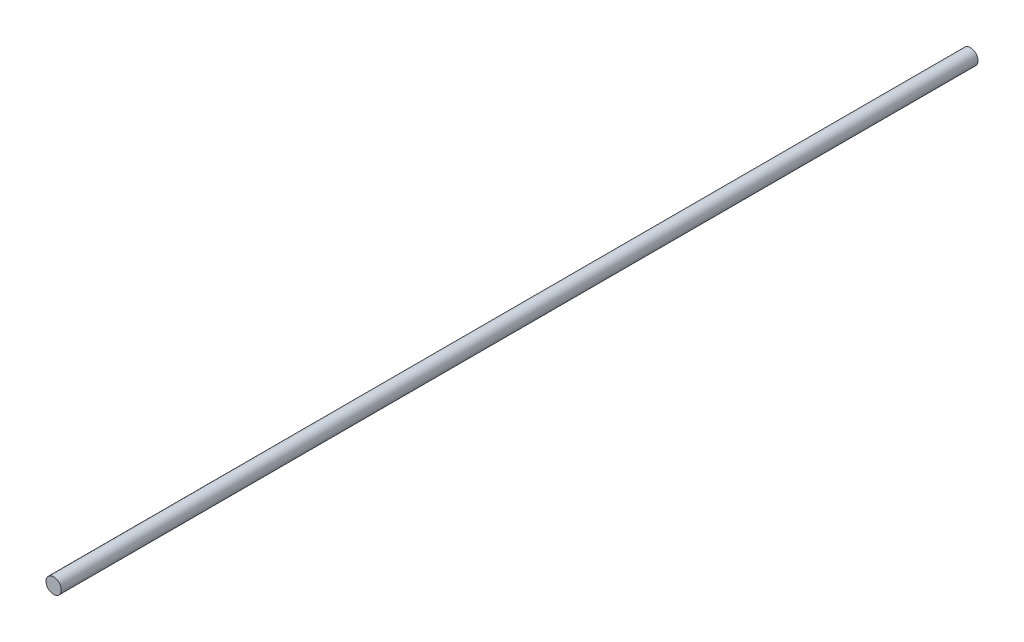
ISO-10303-21;
HEADER;
FILE_DESCRIPTION(('STEP AP214'),'2;1');
FILE_NAME('part.step','',(''),(''),'','','');
FILE_SCHEMA(('AUTOMOTIVE_DESIGN { 1 0 10303 214 1 1 1 1 }'));
ENDSEC;
DATA;
#1=APPLICATION_CONTEXT('core data for automotive mechanical design processes');
#2=APPLICATION_PROTOCOL_DEFINITION('international standard','automotive_design',2000,#1);
#3=PRODUCT_CONTEXT('',#1,'mechanical');
#4=PRODUCT('Part','Part','',(#3));
#5=PRODUCT_RELATED_PRODUCT_CATEGORY('part','',(#4));
#6=PRODUCT_DEFINITION_FORMATION('','',#4);
#7=PRODUCT_DEFINITION_CONTEXT('part definition',#1,'design');
#8=PRODUCT_DEFINITION('design','',#6,#7);
#9=PRODUCT_DEFINITION_SHAPE('','',#8);
#10=(LENGTH_UNIT() NAMED_UNIT(*) SI_UNIT(.MILLI.,.METRE.));
#11=(NAMED_UNIT(*) PLANE_ANGLE_UNIT() SI_UNIT($,.RADIAN.));
#12=(NAMED_UNIT(*) SI_UNIT($,.STERADIAN.) SOLID_ANGLE_UNIT());
#13=UNCERTAINTY_MEASURE_WITH_UNIT(LENGTH_MEASURE(1.E-05),#10,'distance_accuracy_value','');
#14=(GEOMETRIC_REPRESENTATION_CONTEXT(3) GLOBAL_UNCERTAINTY_ASSIGNED_CONTEXT((#13)) GLOBAL_UNIT_ASSIGNED_CONTEXT((#10,
#11,#12)) REPRESENTATION_CONTEXT('',''));
#15=CARTESIAN_POINT('',(0.,0.,0.));
#16=DIRECTION('',(0.,0.,1.));
#17=DIRECTION('',(1.,0.,0.));
#18=AXIS2_PLACEMENT_3D('',#15,#16,#17);
#19=CARTESIAN_POINT('',(0.143759197205251,0.944423648862685,300.));
#20=DIRECTION('',(0.,0.,-1.));
#21=DIRECTION('',(-1.,0.,0.));
#22=AXIS2_PLACEMENT_3D('',#19,#20,#21);
#23=CYLINDRICAL_SURFACE('',#22,2.5);
#24=CARTESIAN_POINT('',(0.143759197205251,0.944423648862685,300.));
#25=DIRECTION('',(0.,0.,1.));
#26=DIRECTION('',(1.,0.,0.));
#27=AXIS2_PLACEMENT_3D('',#24,#25,#26);
#28=CIRCLE('',#27,2.5);
#29=CARTESIAN_POINT('',(2.64375919720525,0.944423648862685,300.));
#30=VERTEX_POINT('',#29);
#31=EDGE_CURVE('E10',#30,#30,#28,.T.);
#32=ORIENTED_EDGE('',*,*,#31,.F.);
#33=EDGE_LOOP('',(#32));
#34=FACE_BOUND('',#33,.T.);
#35=CARTESIAN_POINT('',(0.143759197205251,0.944423648862685,0.));
#36=DIRECTION('',(0.,0.,1.));
#37=DIRECTION('',(1.,0.,0.));
#38=AXIS2_PLACEMENT_3D('',#35,#36,#37);
#39=CIRCLE('',#38,2.5);
#40=CARTESIAN_POINT('',(2.64375919720525,0.944423648862685,0.));
#41=VERTEX_POINT('',#40);
#42=EDGE_CURVE('E46',#41,#41,#39,.T.);
#43=ORIENTED_EDGE('',*,*,#42,.T.);
#44=EDGE_LOOP('',(#43));
#45=FACE_BOUND('',#44,.T.);
#46=ADVANCED_FACE('F43',(#34,#45),#23,.T.);
#47=CARTESIAN_POINT('',(0.143759197205251,0.944423648862685,300.));
#48=DIRECTION('',(0.,0.,1.));
#49=DIRECTION('',(1.,0.,0.));
#50=AXIS2_PLACEMENT_3D('',#47,#48,#49);
#51=PLANE('',#50);
#52=ORIENTED_EDGE('',*,*,#31,.T.);
#53=EDGE_LOOP('',(#52));
#54=FACE_BOUND('',#53,.T.);
#55=ADVANCED_FACE('F60',(#54),#51,.T.);
#56=CARTESIAN_POINT('',(0.143759197205251,0.944423648862685,0.));
#57=DIRECTION('',(0.,0.,1.));
#58=DIRECTION('',(1.,0.,0.));
#59=AXIS2_PLACEMENT_3D('',#56,#57,#58);
#60=PLANE('',#59);
#61=ORIENTED_EDGE('',*,*,#42,.F.);
#62=EDGE_LOOP('',(#61));
#63=FACE_BOUND('',#62,.T.);
#64=ADVANCED_FACE('F58',(#63),#60,.F.);
#65=CLOSED_SHELL('',(#46,#55,#64));
#66=MANIFOLD_SOLID_BREP('B2',#65);
#67=ADVANCED_BREP_SHAPE_REPRESENTATION('',(#18,#66),#14);
#68=SHAPE_DEFINITION_REPRESENTATION(#9,#67);
ENDSEC;
END-ISO-10303-21;
